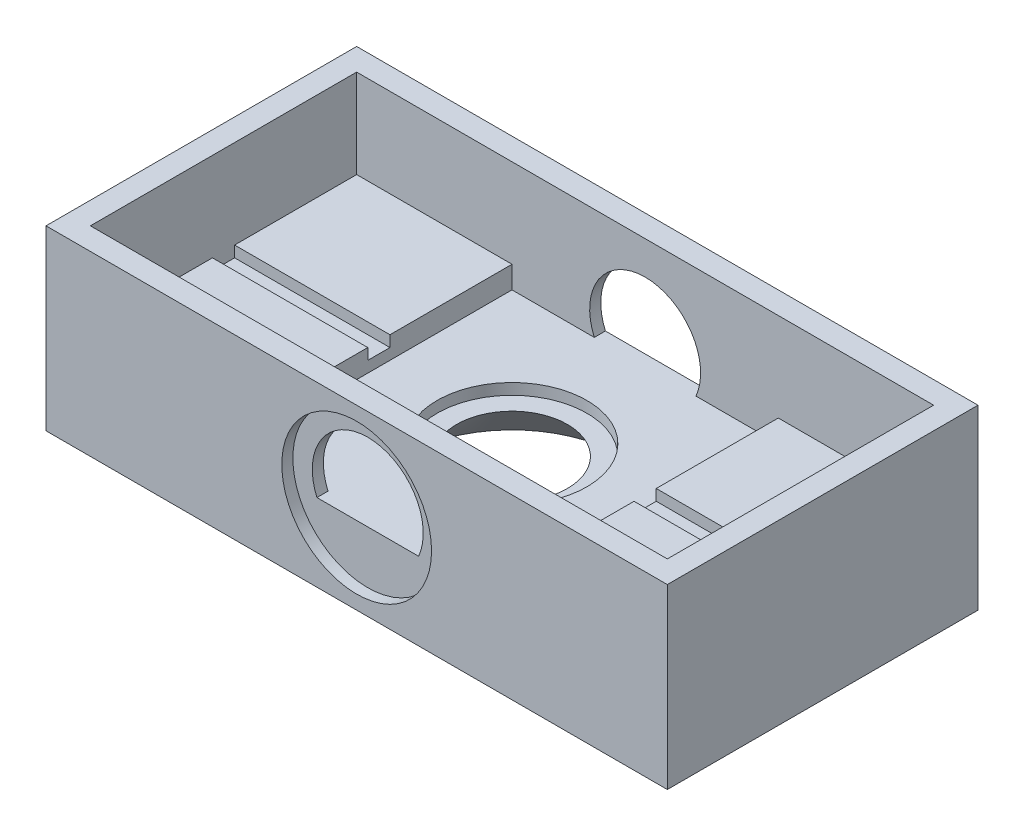
ISO-10303-21;
HEADER;
FILE_DESCRIPTION(('STEP AP214'),'2;1');
FILE_NAME('part.step','',(''),(''),'','','');
FILE_SCHEMA(('AUTOMOTIVE_DESIGN { 1 0 10303 214 1 1 1 1 }'));
ENDSEC;
DATA;
#1=APPLICATION_CONTEXT('core data for automotive mechanical design processes');
#2=APPLICATION_PROTOCOL_DEFINITION('international standard','automotive_design',2000,#1);
#3=PRODUCT_CONTEXT('',#1,'mechanical');
#4=PRODUCT('Part','Part','',(#3));
#5=PRODUCT_RELATED_PRODUCT_CATEGORY('part','',(#4));
#6=PRODUCT_DEFINITION_FORMATION('','',#4);
#7=PRODUCT_DEFINITION_CONTEXT('part definition',#1,'design');
#8=PRODUCT_DEFINITION('design','',#6,#7);
#9=PRODUCT_DEFINITION_SHAPE('','',#8);
#10=(LENGTH_UNIT() NAMED_UNIT(*) SI_UNIT(.MILLI.,.METRE.));
#11=(NAMED_UNIT(*) PLANE_ANGLE_UNIT() SI_UNIT($,.RADIAN.));
#12=(NAMED_UNIT(*) SI_UNIT($,.STERADIAN.) SOLID_ANGLE_UNIT());
#13=UNCERTAINTY_MEASURE_WITH_UNIT(LENGTH_MEASURE(1.E-05),#10,'distance_accuracy_value','');
#14=(GEOMETRIC_REPRESENTATION_CONTEXT(3) GLOBAL_UNCERTAINTY_ASSIGNED_CONTEXT((#13)) GLOBAL_UNIT_ASSIGNED_CONTEXT((#10,
#11,#12)) REPRESENTATION_CONTEXT('',''));
#15=CARTESIAN_POINT('',(0.,0.,0.));
#16=DIRECTION('',(0.,0.,1.));
#17=DIRECTION('',(1.,0.,0.));
#18=AXIS2_PLACEMENT_3D('',#15,#16,#17);
#19=CARTESIAN_POINT('',(0.,8.,-13.));
#20=DIRECTION('',(0.,0.,-1.));
#21=DIRECTION('',(-1.,0.,0.));
#22=AXIS2_PLACEMENT_3D('',#19,#20,#21);
#23=PLANE('',#22);
#24=CARTESIAN_POINT('',(0.,8.,-13.));
#25=DIRECTION('',(0.,0.,-1.));
#26=DIRECTION('',(-1.,0.,0.));
#27=AXIS2_PLACEMENT_3D('',#24,#25,#26);
#28=CIRCLE('',#27,6.75);
#29=CARTESIAN_POINT('',(-6.75,8.,-13.));
#30=VERTEX_POINT('',#29);
#31=EDGE_CURVE('E245',#30,#30,#28,.T.);
#32=ORIENTED_EDGE('',*,*,#31,.T.);
#33=EDGE_LOOP('',(#32));
#34=FACE_BOUND('',#33,.T.);
#35=DIRECTION('',(1.,0.,0.));
#36=VECTOR('',#35,1.);
#37=CARTESIAN_POINT('',(-4.58257569495584,6.,-13.));
#38=LINE('',#37,#36);
#39=CARTESIAN_POINT('',(-4.58257569495584,6.,-13.));
#40=VERTEX_POINT('',#39);
#41=CARTESIAN_POINT('',(4.58257569495584,6.,-13.));
#42=VERTEX_POINT('',#41);
#43=EDGE_CURVE('E206',#40,#42,#38,.T.);
#44=ORIENTED_EDGE('',*,*,#43,.T.);
#45=CARTESIAN_POINT('',(0.,8.,-13.));
#46=DIRECTION('',(0.,0.,-1.));
#47=DIRECTION('',(-1.,0.,0.));
#48=AXIS2_PLACEMENT_3D('',#45,#46,#47);
#49=CIRCLE('',#48,5.);
#50=EDGE_CURVE('E229',#42,#40,#49,.F.);
#51=ORIENTED_EDGE('',*,*,#50,.T.);
#52=EDGE_LOOP('',(#44,#51));
#53=FACE_BOUND('',#52,.T.);
#54=ADVANCED_FACE('F39',(#34,#53),#23,.T.);
#55=CARTESIAN_POINT('',(0.,8.,0.));
#56=DIRECTION('',(0.,1.,0.));
#57=DIRECTION('',(0.,0.,1.));
#58=AXIS2_PLACEMENT_3D('',#55,#56,#57);
#59=PLANE('',#58);
#60=DIRECTION('',(1.,0.,0.));
#61=VECTOR('',#60,1.);
#62=CARTESIAN_POINT('',(-26.,8.,1.));
#63=LINE('',#62,#61);
#64=CARTESIAN_POINT('',(12.,8.,1.));
#65=VERTEX_POINT('',#64);
#66=CARTESIAN_POINT('',(26.,8.,1.));
#67=VERTEX_POINT('',#66);
#68=EDGE_CURVE('E290',#65,#67,#63,.T.);
#69=ORIENTED_EDGE('',*,*,#68,.F.);
#70=DIRECTION('',(0.,0.,-1.));
#71=VECTOR('',#70,1.);
#72=CARTESIAN_POINT('',(12.,8.,12.));
#73=LINE('',#72,#71);
#74=CARTESIAN_POINT('',(12.,8.,12.));
#75=VERTEX_POINT('',#74);
#76=EDGE_CURVE('E337',#75,#65,#73,.T.);
#77=ORIENTED_EDGE('',*,*,#76,.F.);
#78=DIRECTION('',(1.,0.,0.));
#79=VECTOR('',#78,1.);
#80=CARTESIAN_POINT('',(-26.,8.,12.));
#81=LINE('',#80,#79);
#82=CARTESIAN_POINT('',(26.,8.,12.));
#83=VERTEX_POINT('',#82);
#84=EDGE_CURVE('E364',#75,#83,#81,.T.);
#85=ORIENTED_EDGE('',*,*,#84,.T.);
#86=DIRECTION('',(0.,0.,-1.));
#87=VECTOR('',#86,1.);
#88=CARTESIAN_POINT('',(26.,8.,12.));
#89=LINE('',#88,#87);
#90=EDGE_CURVE('E365',#83,#67,#89,.T.);
#91=ORIENTED_EDGE('',*,*,#90,.T.);
#92=EDGE_LOOP('',(#69,#77,#85,#91));
#93=FACE_BOUND('',#92,.T.);
#94=ADVANCED_FACE('F519',(#93),#59,.T.);
#95=CARTESIAN_POINT('',(-26.,8.,1.));
#96=VERTEX_POINT('',#95);
#97=CARTESIAN_POINT('',(-12.,8.,1.));
#98=VERTEX_POINT('',#97);
#99=EDGE_CURVE('E274',#96,#98,#63,.T.);
#100=ORIENTED_EDGE('',*,*,#99,.F.);
#101=DIRECTION('',(0.,0.,1.));
#102=VECTOR('',#101,1.);
#103=CARTESIAN_POINT('',(-26.,8.,-12.));
#104=LINE('',#103,#102);
#105=CARTESIAN_POINT('',(-26.,8.,12.));
#106=VERTEX_POINT('',#105);
#107=EDGE_CURVE('E374',#96,#106,#104,.T.);
#108=ORIENTED_EDGE('',*,*,#107,.T.);
#109=CARTESIAN_POINT('',(-12.,8.,12.));
#110=VERTEX_POINT('',#109);
#111=EDGE_CURVE('E359',#106,#110,#81,.T.);
#112=ORIENTED_EDGE('',*,*,#111,.T.);
#113=DIRECTION('',(0.,0.,1.));
#114=VECTOR('',#113,1.);
#115=CARTESIAN_POINT('',(-12.,8.,12.));
#116=LINE('',#115,#114);
#117=EDGE_CURVE('E341',#98,#110,#116,.T.);
#118=ORIENTED_EDGE('',*,*,#117,.F.);
#119=EDGE_LOOP('',(#100,#108,#112,#118));
#120=FACE_BOUND('',#119,.T.);
#121=ADVANCED_FACE('F482',(#120),#59,.T.);
#122=DIRECTION('',(-1.,0.,0.));
#123=VECTOR('',#122,1.);
#124=CARTESIAN_POINT('',(-26.,8.,-1.));
#125=LINE('',#124,#123);
#126=CARTESIAN_POINT('',(26.,8.,-1.));
#127=VERTEX_POINT('',#126);
#128=CARTESIAN_POINT('',(12.,8.,-1.));
#129=VERTEX_POINT('',#128);
#130=EDGE_CURVE('E287',#127,#129,#125,.T.);
#131=ORIENTED_EDGE('',*,*,#130,.F.);
#132=CARTESIAN_POINT('',(26.,8.,-12.));
#133=VERTEX_POINT('',#132);
#134=EDGE_CURVE('E363',#127,#133,#89,.T.);
#135=ORIENTED_EDGE('',*,*,#134,.T.);
#136=DIRECTION('',(-1.,0.,0.));
#137=VECTOR('',#136,1.);
#138=CARTESIAN_POINT('',(26.,8.,-12.));
#139=LINE('',#138,#137);
#140=CARTESIAN_POINT('',(12.,8.,-12.));
#141=VERTEX_POINT('',#140);
#142=EDGE_CURVE('E370',#133,#141,#139,.T.);
#143=ORIENTED_EDGE('',*,*,#142,.T.);
#144=EDGE_CURVE('E318',#129,#141,#73,.T.);
#145=ORIENTED_EDGE('',*,*,#144,.F.);
#146=EDGE_LOOP('',(#131,#135,#143,#145));
#147=FACE_BOUND('',#146,.T.);
#148=ADVANCED_FACE('F574',(#147),#59,.T.);
#149=CARTESIAN_POINT('',(28.,16.,14.));
#150=DIRECTION('',(-1.,0.,0.));
#151=DIRECTION('',(0.,0.,1.));
#152=AXIS2_PLACEMENT_3D('',#149,#150,#151);
#153=PLANE('',#152);
#154=DIRECTION('',(0.,0.,-1.));
#155=VECTOR('',#154,1.);
#156=CARTESIAN_POINT('',(28.,0.,14.));
#157=LINE('',#156,#155);
#158=CARTESIAN_POINT('',(28.,0.,14.));
#159=VERTEX_POINT('',#158);
#160=CARTESIAN_POINT('',(28.,0.,-14.));
#161=VERTEX_POINT('',#160);
#162=EDGE_CURVE('E397',#159,#161,#157,.T.);
#163=ORIENTED_EDGE('',*,*,#162,.T.);
#164=DIRECTION('',(0.,-1.,0.));
#165=VECTOR('',#164,1.);
#166=CARTESIAN_POINT('',(28.,16.,-14.));
#167=LINE('',#166,#165);
#168=CARTESIAN_POINT('',(28.,16.,-14.));
#169=VERTEX_POINT('',#168);
#170=EDGE_CURVE('E444',#169,#161,#167,.T.);
#171=ORIENTED_EDGE('',*,*,#170,.F.);
#172=DIRECTION('',(0.,0.,-1.));
#173=VECTOR('',#172,1.);
#174=CARTESIAN_POINT('',(28.,16.,14.));
#175=LINE('',#174,#173);
#176=CARTESIAN_POINT('',(28.,16.,14.));
#177=VERTEX_POINT('',#176);
#178=EDGE_CURVE('E407',#177,#169,#175,.T.);
#179=ORIENTED_EDGE('',*,*,#178,.F.);
#180=DIRECTION('',(0.,-1.,0.));
#181=VECTOR('',#180,1.);
#182=CARTESIAN_POINT('',(28.,16.,14.));
#183=LINE('',#182,#181);
#184=EDGE_CURVE('E421',#177,#159,#183,.T.);
#185=ORIENTED_EDGE('',*,*,#184,.T.);
#186=EDGE_LOOP('',(#163,#171,#179,#185));
#187=FACE_BOUND('',#186,.T.);
#188=ADVANCED_FACE('F41',(#187),#153,.F.);
#189=CARTESIAN_POINT('',(-28.,16.,-14.));
#190=DIRECTION('',(0.,0.,1.));
#191=DIRECTION('',(1.,0.,0.));
#192=AXIS2_PLACEMENT_3D('',#189,#190,#191);
#193=PLANE('',#192);
#194=CARTESIAN_POINT('',(0.,8.,-14.));
#195=DIRECTION('',(0.,0.,-1.));
#196=DIRECTION('',(-1.,0.,0.));
#197=AXIS2_PLACEMENT_3D('',#194,#195,#196);
#198=CIRCLE('',#197,6.75);
#199=CARTESIAN_POINT('',(-6.75,8.,-14.));
#200=VERTEX_POINT('',#199);
#201=EDGE_CURVE('E244',#200,#200,#198,.T.);
#202=ORIENTED_EDGE('',*,*,#201,.F.);
#203=EDGE_LOOP('',(#202));
#204=FACE_BOUND('',#203,.T.);
#205=DIRECTION('',(-1.,0.,0.));
#206=VECTOR('',#205,1.);
#207=CARTESIAN_POINT('',(-28.,0.,-14.));
#208=LINE('',#207,#206);
#209=CARTESIAN_POINT('',(-28.,0.,-14.));
#210=VERTEX_POINT('',#209);
#211=EDGE_CURVE('E425',#161,#210,#208,.T.);
#212=ORIENTED_EDGE('',*,*,#211,.T.);
#213=DIRECTION('',(0.,-1.,0.));
#214=VECTOR('',#213,1.);
#215=CARTESIAN_POINT('',(-28.,16.,-14.));
#216=LINE('',#215,#214);
#217=CARTESIAN_POINT('',(-28.,16.,-14.));
#218=VERTEX_POINT('',#217);
#219=EDGE_CURVE('E440',#218,#210,#216,.T.);
#220=ORIENTED_EDGE('',*,*,#219,.F.);
#221=DIRECTION('',(-1.,0.,0.));
#222=VECTOR('',#221,1.);
#223=CARTESIAN_POINT('',(-28.,16.,-14.));
#224=LINE('',#223,#222);
#225=EDGE_CURVE('E411',#169,#218,#224,.T.);
#226=ORIENTED_EDGE('',*,*,#225,.F.);
#227=ORIENTED_EDGE('',*,*,#170,.T.);
#228=EDGE_LOOP('',(#212,#220,#226,#227));
#229=FACE_BOUND('',#228,.T.);
#230=ADVANCED_FACE('F598',(#204,#229),#193,.F.);
#231=CARTESIAN_POINT('',(-28.,16.,14.));
#232=DIRECTION('',(1.,0.,0.));
#233=DIRECTION('',(0.,0.,-1.));
#234=AXIS2_PLACEMENT_3D('',#231,#232,#233);
#235=PLANE('',#234);
#236=DIRECTION('',(0.,0.,1.));
#237=VECTOR('',#236,1.);
#238=CARTESIAN_POINT('',(-28.,0.,14.));
#239=LINE('',#238,#237);
#240=CARTESIAN_POINT('',(-28.,0.,14.));
#241=VERTEX_POINT('',#240);
#242=EDGE_CURVE('E428',#210,#241,#239,.T.);
#243=ORIENTED_EDGE('',*,*,#242,.T.);
#244=DIRECTION('',(0.,-1.,0.));
#245=VECTOR('',#244,1.);
#246=CARTESIAN_POINT('',(-28.,16.,14.));
#247=LINE('',#246,#245);
#248=CARTESIAN_POINT('',(-28.,16.,14.));
#249=VERTEX_POINT('',#248);
#250=EDGE_CURVE('E436',#249,#241,#247,.T.);
#251=ORIENTED_EDGE('',*,*,#250,.F.);
#252=DIRECTION('',(0.,0.,1.));
#253=VECTOR('',#252,1.);
#254=CARTESIAN_POINT('',(-28.,16.,14.));
#255=LINE('',#254,#253);
#256=EDGE_CURVE('E415',#218,#249,#255,.T.);
#257=ORIENTED_EDGE('',*,*,#256,.F.);
#258=ORIENTED_EDGE('',*,*,#219,.T.);
#259=EDGE_LOOP('',(#243,#251,#257,#258));
#260=FACE_BOUND('',#259,.T.);
#261=ADVANCED_FACE('F595',(#260),#235,.F.);
#262=CARTESIAN_POINT('',(-28.,16.,14.));
#263=DIRECTION('',(0.,0.,-1.));
#264=DIRECTION('',(-1.,0.,0.));
#265=AXIS2_PLACEMENT_3D('',#262,#263,#264);
#266=PLANE('',#265);
#267=CARTESIAN_POINT('',(0.,8.,14.));
#268=DIRECTION('',(0.,0.,1.));
#269=DIRECTION('',(1.,0.,0.));
#270=AXIS2_PLACEMENT_3D('',#267,#268,#269);
#271=CIRCLE('',#270,6.75);
#272=CARTESIAN_POINT('',(6.75,8.,14.));
#273=VERTEX_POINT('',#272);
#274=EDGE_CURVE('E249',#273,#273,#271,.T.);
#275=ORIENTED_EDGE('',*,*,#274,.F.);
#276=EDGE_LOOP('',(#275));
#277=FACE_BOUND('',#276,.T.);
#278=DIRECTION('',(1.,0.,0.));
#279=VECTOR('',#278,1.);
#280=CARTESIAN_POINT('',(-28.,0.,14.));
#281=LINE('',#280,#279);
#282=EDGE_CURVE('E412',#241,#159,#281,.T.);
#283=ORIENTED_EDGE('',*,*,#282,.T.);
#284=ORIENTED_EDGE('',*,*,#184,.F.);
#285=DIRECTION('',(1.,0.,0.));
#286=VECTOR('',#285,1.);
#287=CARTESIAN_POINT('',(-28.,16.,14.));
#288=LINE('',#287,#286);
#289=EDGE_CURVE('E418',#249,#177,#288,.T.);
#290=ORIENTED_EDGE('',*,*,#289,.F.);
#291=ORIENTED_EDGE('',*,*,#250,.T.);
#292=EDGE_LOOP('',(#283,#284,#290,#291));
#293=FACE_BOUND('',#292,.T.);
#294=ADVANCED_FACE('F588',(#277,#293),#266,.F.);
#295=CARTESIAN_POINT('',(0.,16.,0.));
#296=DIRECTION('',(0.,-1.,0.));
#297=DIRECTION('',(0.,0.,-1.));
#298=AXIS2_PLACEMENT_3D('',#295,#296,#297);
#299=PLANE('',#298);
#300=DIRECTION('',(0.,0.,-1.));
#301=VECTOR('',#300,1.);
#302=CARTESIAN_POINT('',(26.,16.,12.));
#303=LINE('',#302,#301);
#304=CARTESIAN_POINT('',(26.,16.,12.));
#305=VERTEX_POINT('',#304);
#306=CARTESIAN_POINT('',(26.,16.,-12.));
#307=VERTEX_POINT('',#306);
#308=EDGE_CURVE('E382',#305,#307,#303,.T.);
#309=ORIENTED_EDGE('',*,*,#308,.F.);
#310=DIRECTION('',(1.,0.,0.));
#311=VECTOR('',#310,1.);
#312=CARTESIAN_POINT('',(-26.,16.,12.));
#313=LINE('',#312,#311);
#314=CARTESIAN_POINT('',(-26.,16.,12.));
#315=VERTEX_POINT('',#314);
#316=EDGE_CURVE('E348',#315,#305,#313,.T.);
#317=ORIENTED_EDGE('',*,*,#316,.F.);
#318=DIRECTION('',(0.,0.,1.));
#319=VECTOR('',#318,1.);
#320=CARTESIAN_POINT('',(-26.,16.,-12.));
#321=LINE('',#320,#319);
#322=CARTESIAN_POINT('',(-26.,16.,-12.));
#323=VERTEX_POINT('',#322);
#324=EDGE_CURVE('E390',#323,#315,#321,.T.);
#325=ORIENTED_EDGE('',*,*,#324,.F.);
#326=DIRECTION('',(-1.,0.,0.));
#327=VECTOR('',#326,1.);
#328=CARTESIAN_POINT('',(26.,16.,-12.));
#329=LINE('',#328,#327);
#330=EDGE_CURVE('E386',#307,#323,#329,.T.);
#331=ORIENTED_EDGE('',*,*,#330,.F.);
#332=EDGE_LOOP('',(#309,#317,#325,#331));
#333=FACE_BOUND('',#332,.T.);
#334=ORIENTED_EDGE('',*,*,#178,.T.);
#335=ORIENTED_EDGE('',*,*,#225,.T.);
#336=ORIENTED_EDGE('',*,*,#256,.T.);
#337=ORIENTED_EDGE('',*,*,#289,.T.);
#338=EDGE_LOOP('',(#334,#335,#336,#337));
#339=FACE_BOUND('',#338,.T.);
#340=ADVANCED_FACE('F585',(#333,#339),#299,.F.);
#341=CARTESIAN_POINT('',(0.,0.,0.));
#342=DIRECTION('',(0.,-1.,0.));
#343=DIRECTION('',(0.,0.,-1.));
#344=AXIS2_PLACEMENT_3D('',#341,#342,#343);
#345=PLANE('',#344);
#346=CARTESIAN_POINT('',(0.,0.,0.));
#347=DIRECTION('',(0.,1.,0.));
#348=DIRECTION('',(0.,0.,1.));
#349=AXIS2_PLACEMENT_3D('',#346,#347,#348);
#350=CIRCLE('',#349,10.);
#351=CARTESIAN_POINT('',(0.,0.,10.));
#352=VERTEX_POINT('',#351);
#353=EDGE_CURVE('E223',#352,#352,#350,.T.);
#354=ORIENTED_EDGE('',*,*,#353,.T.);
#355=EDGE_LOOP('',(#354));
#356=FACE_BOUND('',#355,.T.);
#357=ORIENTED_EDGE('',*,*,#162,.F.);
#358=ORIENTED_EDGE('',*,*,#282,.F.);
#359=ORIENTED_EDGE('',*,*,#242,.F.);
#360=ORIENTED_EDGE('',*,*,#211,.F.);
#361=EDGE_LOOP('',(#357,#358,#359,#360));
#362=FACE_BOUND('',#361,.T.);
#363=ADVANCED_FACE('F584',(#356,#362),#345,.T.);
#364=CARTESIAN_POINT('',(-26.,8.,12.));
#365=DIRECTION('',(0.,0.,1.));
#366=DIRECTION('',(1.,0.,0.));
#367=AXIS2_PLACEMENT_3D('',#364,#365,#366);
#368=PLANE('',#367);
#369=DIRECTION('',(1.,0.,0.));
#370=VECTOR('',#369,1.);
#371=CARTESIAN_POINT('',(-12.,6.,12.));
#372=LINE('',#371,#370);
#373=CARTESIAN_POINT('',(4.58257569495584,6.,12.));
#374=VERTEX_POINT('',#373);
#375=CARTESIAN_POINT('',(12.,6.,12.));
#376=VERTEX_POINT('',#375);
#377=EDGE_CURVE('E332',#374,#376,#372,.T.);
#378=ORIENTED_EDGE('',*,*,#377,.F.);
#379=CARTESIAN_POINT('',(0.,8.,12.));
#380=DIRECTION('',(0.,0.,1.));
#381=DIRECTION('',(1.,0.,0.));
#382=AXIS2_PLACEMENT_3D('',#379,#380,#381);
#383=CIRCLE('',#382,5.);
#384=CARTESIAN_POINT('',(-4.58257569495584,6.,12.));
#385=VERTEX_POINT('',#384);
#386=EDGE_CURVE('E203',#374,#385,#383,.T.);
#387=ORIENTED_EDGE('',*,*,#386,.T.);
#388=CARTESIAN_POINT('',(-12.,6.,12.));
#389=VERTEX_POINT('',#388);
#390=EDGE_CURVE('E333',#389,#385,#372,.T.);
#391=ORIENTED_EDGE('',*,*,#390,.F.);
#392=DIRECTION('',(0.,1.,0.));
#393=VECTOR('',#392,1.);
#394=CARTESIAN_POINT('',(-12.,6.,12.));
#395=LINE('',#394,#393);
#396=EDGE_CURVE('E349',#389,#110,#395,.T.);
#397=ORIENTED_EDGE('',*,*,#396,.T.);
#398=ORIENTED_EDGE('',*,*,#111,.F.);
#399=DIRECTION('',(0.,1.,0.));
#400=VECTOR('',#399,1.);
#401=CARTESIAN_POINT('',(-26.,8.,12.));
#402=LINE('',#401,#400);
#403=EDGE_CURVE('E394',#106,#315,#402,.T.);
#404=ORIENTED_EDGE('',*,*,#403,.T.);
#405=ORIENTED_EDGE('',*,*,#316,.T.);
#406=DIRECTION('',(0.,1.,0.));
#407=VECTOR('',#406,1.);
#408=CARTESIAN_POINT('',(26.,8.,12.));
#409=LINE('',#408,#407);
#410=EDGE_CURVE('E379',#83,#305,#409,.T.);
#411=ORIENTED_EDGE('',*,*,#410,.F.);
#412=ORIENTED_EDGE('',*,*,#84,.F.);
#413=DIRECTION('',(0.,1.,0.));
#414=VECTOR('',#413,1.);
#415=CARTESIAN_POINT('',(12.,6.,12.));
#416=LINE('',#415,#414);
#417=EDGE_CURVE('E345',#376,#75,#416,.T.);
#418=ORIENTED_EDGE('',*,*,#417,.F.);
#419=EDGE_LOOP('',(#378,#387,#391,#397,#398,#404,#405,#411,#412,#418));
#420=FACE_BOUND('',#419,.T.);
#421=ADVANCED_FACE('F490',(#420),#368,.F.);
#422=CARTESIAN_POINT('',(-26.,8.,-12.));
#423=DIRECTION('',(-1.,0.,0.));
#424=DIRECTION('',(0.,0.,1.));
#425=AXIS2_PLACEMENT_3D('',#422,#423,#424);
#426=PLANE('',#425);
#427=ORIENTED_EDGE('',*,*,#324,.T.);
#428=ORIENTED_EDGE('',*,*,#403,.F.);
#429=ORIENTED_EDGE('',*,*,#107,.F.);
#430=DIRECTION('',(0.,1.,0.));
#431=VECTOR('',#430,1.);
#432=CARTESIAN_POINT('',(-26.,7.,1.));
#433=LINE('',#432,#431);
#434=CARTESIAN_POINT('',(-26.,7.,1.));
#435=VERTEX_POINT('',#434);
#436=EDGE_CURVE('E298',#435,#96,#433,.T.);
#437=ORIENTED_EDGE('',*,*,#436,.F.);
#438=DIRECTION('',(0.,0.,1.));
#439=VECTOR('',#438,1.);
#440=CARTESIAN_POINT('',(-26.,7.,1.));
#441=LINE('',#440,#439);
#442=CARTESIAN_POINT('',(-26.,7.,-1.));
#443=VERTEX_POINT('',#442);
#444=EDGE_CURVE('E278',#443,#435,#441,.T.);
#445=ORIENTED_EDGE('',*,*,#444,.F.);
#446=DIRECTION('',(0.,1.,0.));
#447=VECTOR('',#446,1.);
#448=CARTESIAN_POINT('',(-26.,7.,-1.));
#449=LINE('',#448,#447);
#450=CARTESIAN_POINT('',(-26.,8.,-1.));
#451=VERTEX_POINT('',#450);
#452=EDGE_CURVE('E301',#443,#451,#449,.T.);
#453=ORIENTED_EDGE('',*,*,#452,.T.);
#454=CARTESIAN_POINT('',(-26.,8.,-12.));
#455=VERTEX_POINT('',#454);
#456=EDGE_CURVE('E375',#455,#451,#104,.T.);
#457=ORIENTED_EDGE('',*,*,#456,.F.);
#458=DIRECTION('',(0.,1.,0.));
#459=VECTOR('',#458,1.);
#460=CARTESIAN_POINT('',(-26.,8.,-12.));
#461=LINE('',#460,#459);
#462=EDGE_CURVE('E398',#455,#323,#461,.T.);
#463=ORIENTED_EDGE('',*,*,#462,.T.);
#464=EDGE_LOOP('',(#427,#428,#429,#437,#445,#453,#457,#463));
#465=FACE_BOUND('',#464,.T.);
#466=ADVANCED_FACE('F486',(#465),#426,.F.);
#467=CARTESIAN_POINT('',(26.,8.,-12.));
#468=DIRECTION('',(0.,0.,-1.));
#469=DIRECTION('',(-1.,0.,0.));
#470=AXIS2_PLACEMENT_3D('',#467,#468,#469);
#471=PLANE('',#470);
#472=DIRECTION('',(-1.,0.,0.));
#473=VECTOR('',#472,1.);
#474=CARTESIAN_POINT('',(-12.,6.,-12.));
#475=LINE('',#474,#473);
#476=CARTESIAN_POINT('',(-4.58257569495584,6.,-12.));
#477=VERTEX_POINT('',#476);
#478=CARTESIAN_POINT('',(-12.,6.,-12.));
#479=VERTEX_POINT('',#478);
#480=EDGE_CURVE('E323',#477,#479,#475,.T.);
#481=ORIENTED_EDGE('',*,*,#480,.F.);
#482=CARTESIAN_POINT('',(0.,8.,-12.));
#483=DIRECTION('',(0.,0.,-1.));
#484=DIRECTION('',(-1.,0.,0.));
#485=AXIS2_PLACEMENT_3D('',#482,#483,#484);
#486=CIRCLE('',#485,5.);
#487=CARTESIAN_POINT('',(4.58257569495584,6.,-12.));
#488=VERTEX_POINT('',#487);
#489=EDGE_CURVE('E238',#477,#488,#486,.T.);
#490=ORIENTED_EDGE('',*,*,#489,.T.);
#491=CARTESIAN_POINT('',(12.,6.,-12.));
#492=VERTEX_POINT('',#491);
#493=EDGE_CURVE('E325',#492,#488,#475,.T.);
#494=ORIENTED_EDGE('',*,*,#493,.F.);
#495=DIRECTION('',(0.,1.,0.));
#496=VECTOR('',#495,1.);
#497=CARTESIAN_POINT('',(12.,6.,-12.));
#498=LINE('',#497,#496);
#499=EDGE_CURVE('E336',#492,#141,#498,.T.);
#500=ORIENTED_EDGE('',*,*,#499,.T.);
#501=ORIENTED_EDGE('',*,*,#142,.F.);
#502=DIRECTION('',(0.,1.,0.));
#503=VECTOR('',#502,1.);
#504=CARTESIAN_POINT('',(26.,8.,-12.));
#505=LINE('',#504,#503);
#506=EDGE_CURVE('E401',#133,#307,#505,.T.);
#507=ORIENTED_EDGE('',*,*,#506,.T.);
#508=ORIENTED_EDGE('',*,*,#330,.T.);
#509=ORIENTED_EDGE('',*,*,#462,.F.);
#510=CARTESIAN_POINT('',(-12.,8.,-12.));
#511=VERTEX_POINT('',#510);
#512=EDGE_CURVE('E369',#511,#455,#139,.T.);
#513=ORIENTED_EDGE('',*,*,#512,.F.);
#514=DIRECTION('',(0.,1.,0.));
#515=VECTOR('',#514,1.);
#516=CARTESIAN_POINT('',(-12.,6.,-12.));
#517=LINE('',#516,#515);
#518=EDGE_CURVE('E353',#479,#511,#517,.T.);
#519=ORIENTED_EDGE('',*,*,#518,.F.);
#520=EDGE_LOOP('',(#481,#490,#494,#500,#501,#507,#508,#509,#513,#519));
#521=FACE_BOUND('',#520,.T.);
#522=ADVANCED_FACE('F497',(#521),#471,.F.);
#523=CARTESIAN_POINT('',(26.,8.,12.));
#524=DIRECTION('',(1.,0.,0.));
#525=DIRECTION('',(0.,0.,-1.));
#526=AXIS2_PLACEMENT_3D('',#523,#524,#525);
#527=PLANE('',#526);
#528=ORIENTED_EDGE('',*,*,#308,.T.);
#529=ORIENTED_EDGE('',*,*,#506,.F.);
#530=ORIENTED_EDGE('',*,*,#134,.F.);
#531=DIRECTION('',(0.,1.,0.));
#532=VECTOR('',#531,1.);
#533=CARTESIAN_POINT('',(26.,7.,-1.));
#534=LINE('',#533,#532);
#535=CARTESIAN_POINT('',(26.,7.,-1.));
#536=VERTEX_POINT('',#535);
#537=EDGE_CURVE('E286',#536,#127,#534,.T.);
#538=ORIENTED_EDGE('',*,*,#537,.F.);
#539=DIRECTION('',(0.,0.,-1.));
#540=VECTOR('',#539,1.);
#541=CARTESIAN_POINT('',(26.,7.,1.));
#542=LINE('',#541,#540);
#543=CARTESIAN_POINT('',(26.,7.,1.));
#544=VERTEX_POINT('',#543);
#545=EDGE_CURVE('E269',#544,#536,#542,.T.);
#546=ORIENTED_EDGE('',*,*,#545,.F.);
#547=DIRECTION('',(0.,1.,0.));
#548=VECTOR('',#547,1.);
#549=CARTESIAN_POINT('',(26.,7.,1.));
#550=LINE('',#549,#548);
#551=EDGE_CURVE('E293',#544,#67,#550,.T.);
#552=ORIENTED_EDGE('',*,*,#551,.T.);
#553=ORIENTED_EDGE('',*,*,#90,.F.);
#554=ORIENTED_EDGE('',*,*,#410,.T.);
#555=EDGE_LOOP('',(#528,#529,#530,#538,#546,#552,#553,#554));
#556=FACE_BOUND('',#555,.T.);
#557=ADVANCED_FACE('F573',(#556),#527,.F.);
#558=CARTESIAN_POINT('',(-12.,8.,-1.));
#559=VERTEX_POINT('',#558);
#560=EDGE_CURVE('E265',#559,#451,#125,.T.);
#561=ORIENTED_EDGE('',*,*,#560,.F.);
#562=EDGE_CURVE('E324',#511,#559,#116,.T.);
#563=ORIENTED_EDGE('',*,*,#562,.F.);
#564=ORIENTED_EDGE('',*,*,#512,.T.);
#565=ORIENTED_EDGE('',*,*,#456,.T.);
#566=EDGE_LOOP('',(#561,#563,#564,#565));
#567=FACE_BOUND('',#566,.T.);
#568=ADVANCED_FACE('F462',(#567),#59,.T.);
#569=CARTESIAN_POINT('',(12.,6.,12.));
#570=DIRECTION('',(1.,0.,0.));
#571=DIRECTION('',(0.,0.,-1.));
#572=AXIS2_PLACEMENT_3D('',#569,#570,#571);
#573=PLANE('',#572);
#574=ORIENTED_EDGE('',*,*,#76,.T.);
#575=DIRECTION('',(0.,-1.,0.));
#576=VECTOR('',#575,1.);
#577=CARTESIAN_POINT('',(12.,6.,0.999999999999999));
#578=LINE('',#577,#576);
#579=CARTESIAN_POINT('',(12.,7.,1.));
#580=VERTEX_POINT('',#579);
#581=EDGE_CURVE('E314',#65,#580,#578,.T.);
#582=ORIENTED_EDGE('',*,*,#581,.T.);
#583=DIRECTION('',(0.,0.,-1.));
#584=VECTOR('',#583,1.);
#585=CARTESIAN_POINT('',(12.,7.,12.));
#586=LINE('',#585,#584);
#587=CARTESIAN_POINT('',(12.,7.,-1.));
#588=VERTEX_POINT('',#587);
#589=EDGE_CURVE('E297',#580,#588,#586,.T.);
#590=ORIENTED_EDGE('',*,*,#589,.T.);
#591=DIRECTION('',(0.,1.,0.));
#592=VECTOR('',#591,1.);
#593=CARTESIAN_POINT('',(12.,6.,-0.999999999999999));
#594=LINE('',#593,#592);
#595=EDGE_CURVE('E310',#588,#129,#594,.T.);
#596=ORIENTED_EDGE('',*,*,#595,.T.);
#597=ORIENTED_EDGE('',*,*,#144,.T.);
#598=ORIENTED_EDGE('',*,*,#499,.F.);
#599=DIRECTION('',(0.,0.,-1.));
#600=VECTOR('',#599,1.);
#601=CARTESIAN_POINT('',(12.,6.,12.));
#602=LINE('',#601,#600);
#603=EDGE_CURVE('E319',#376,#492,#602,.T.);
#604=ORIENTED_EDGE('',*,*,#603,.F.);
#605=ORIENTED_EDGE('',*,*,#417,.T.);
#606=EDGE_LOOP('',(#574,#582,#590,#596,#597,#598,#604,#605));
#607=FACE_BOUND('',#606,.T.);
#608=ADVANCED_FACE('F565',(#607),#573,.F.);
#609=CARTESIAN_POINT('',(-12.,6.,12.));
#610=DIRECTION('',(-1.,0.,0.));
#611=DIRECTION('',(0.,0.,1.));
#612=AXIS2_PLACEMENT_3D('',#609,#610,#611);
#613=PLANE('',#612);
#614=DIRECTION('',(0.,0.,1.));
#615=VECTOR('',#614,1.);
#616=CARTESIAN_POINT('',(-12.,7.,12.));
#617=LINE('',#616,#615);
#618=CARTESIAN_POINT('',(-12.,7.,-1.));
#619=VERTEX_POINT('',#618);
#620=CARTESIAN_POINT('',(-12.,7.,1.));
#621=VERTEX_POINT('',#620);
#622=EDGE_CURVE('E448',#619,#621,#617,.T.);
#623=ORIENTED_EDGE('',*,*,#622,.T.);
#624=DIRECTION('',(0.,1.,0.));
#625=VECTOR('',#624,1.);
#626=CARTESIAN_POINT('',(-12.,6.,0.999999999999999));
#627=LINE('',#626,#625);
#628=EDGE_CURVE('E11',#621,#98,#627,.T.);
#629=ORIENTED_EDGE('',*,*,#628,.T.);
#630=ORIENTED_EDGE('',*,*,#117,.T.);
#631=ORIENTED_EDGE('',*,*,#396,.F.);
#632=DIRECTION('',(0.,0.,1.));
#633=VECTOR('',#632,1.);
#634=CARTESIAN_POINT('',(-12.,6.,12.));
#635=LINE('',#634,#633);
#636=EDGE_CURVE('E328',#479,#389,#635,.T.);
#637=ORIENTED_EDGE('',*,*,#636,.F.);
#638=ORIENTED_EDGE('',*,*,#518,.T.);
#639=ORIENTED_EDGE('',*,*,#562,.T.);
#640=DIRECTION('',(0.,-1.,0.));
#641=VECTOR('',#640,1.);
#642=CARTESIAN_POINT('',(-12.,6.,-0.999999999999999));
#643=LINE('',#642,#641);
#644=EDGE_CURVE('E48',#559,#619,#643,.T.);
#645=ORIENTED_EDGE('',*,*,#644,.T.);
#646=EDGE_LOOP('',(#623,#629,#630,#631,#637,#638,#639,#645));
#647=FACE_BOUND('',#646,.T.);
#648=ADVANCED_FACE('F454',(#647),#613,.F.);
#649=CARTESIAN_POINT('',(0.,6.,0.));
#650=DIRECTION('',(0.,-1.,0.));
#651=DIRECTION('',(0.,0.,-1.));
#652=AXIS2_PLACEMENT_3D('',#649,#650,#651);
#653=PLANE('',#652);
#654=CARTESIAN_POINT('',(0.,6.,0.));
#655=DIRECTION('',(0.,1.,0.));
#656=DIRECTION('',(0.,0.,1.));
#657=AXIS2_PLACEMENT_3D('',#654,#655,#656);
#658=CIRCLE('',#657,6.75);
#659=CARTESIAN_POINT('',(0.,6.,6.75));
#660=VERTEX_POINT('',#659);
#661=EDGE_CURVE('E257',#660,#660,#658,.T.);
#662=ORIENTED_EDGE('',*,*,#661,.F.);
#663=EDGE_LOOP('',(#662));
#664=FACE_BOUND('',#663,.T.);
#665=ORIENTED_EDGE('',*,*,#390,.T.);
#666=DIRECTION('',(0.,0.,1.));
#667=VECTOR('',#666,1.);
#668=CARTESIAN_POINT('',(-4.58257569495584,6.,-25.2065556157337));
#669=LINE('',#668,#667);
#670=CARTESIAN_POINT('',(-4.58257569495584,6.,13.));
#671=VERTEX_POINT('',#670);
#672=EDGE_CURVE('E212',#385,#671,#669,.T.);
#673=ORIENTED_EDGE('',*,*,#672,.T.);
#674=DIRECTION('',(1.,0.,0.));
#675=VECTOR('',#674,1.);
#676=CARTESIAN_POINT('',(-4.58257569495584,6.,13.));
#677=LINE('',#676,#675);
#678=CARTESIAN_POINT('',(4.58257569495584,6.,13.));
#679=VERTEX_POINT('',#678);
#680=EDGE_CURVE('E209',#671,#679,#677,.T.);
#681=ORIENTED_EDGE('',*,*,#680,.T.);
#682=DIRECTION('',(0.,0.,1.));
#683=VECTOR('',#682,1.);
#684=CARTESIAN_POINT('',(4.58257569495584,6.,-25.2065556157337));
#685=LINE('',#684,#683);
#686=EDGE_CURVE('E199',#374,#679,#685,.T.);
#687=ORIENTED_EDGE('',*,*,#686,.F.);
#688=ORIENTED_EDGE('',*,*,#377,.T.);
#689=ORIENTED_EDGE('',*,*,#603,.T.);
#690=ORIENTED_EDGE('',*,*,#493,.T.);
#691=EDGE_CURVE('E63',#42,#488,#685,.T.);
#692=ORIENTED_EDGE('',*,*,#691,.F.);
#693=ORIENTED_EDGE('',*,*,#43,.F.);
#694=EDGE_CURVE('E234',#40,#477,#669,.T.);
#695=ORIENTED_EDGE('',*,*,#694,.T.);
#696=ORIENTED_EDGE('',*,*,#480,.T.);
#697=ORIENTED_EDGE('',*,*,#636,.T.);
#698=EDGE_LOOP('',(#665,#673,#681,#687,#688,#689,#690,#692,#693,#695,#696,#697));
#699=FACE_BOUND('',#698,.T.);
#700=ADVANCED_FACE('F211',(#664,#699),#653,.F.);
#701=CARTESIAN_POINT('',(0.,7.,0.));
#702=DIRECTION('',(0.,-1.,0.));
#703=DIRECTION('',(0.,0.,-1.));
#704=AXIS2_PLACEMENT_3D('',#701,#702,#703);
#705=PLANE('',#704);
#706=DIRECTION('',(-1.,0.,0.));
#707=VECTOR('',#706,1.);
#708=CARTESIAN_POINT('',(-26.,7.,-1.));
#709=LINE('',#708,#707);
#710=EDGE_CURVE('E273',#619,#443,#709,.T.);
#711=ORIENTED_EDGE('',*,*,#710,.T.);
#712=ORIENTED_EDGE('',*,*,#444,.T.);
#713=DIRECTION('',(1.,0.,0.));
#714=VECTOR('',#713,1.);
#715=CARTESIAN_POINT('',(-26.,7.,1.));
#716=LINE('',#715,#714);
#717=EDGE_CURVE('E283',#435,#621,#716,.T.);
#718=ORIENTED_EDGE('',*,*,#717,.T.);
#719=ORIENTED_EDGE('',*,*,#622,.F.);
#720=EDGE_LOOP('',(#711,#712,#718,#719));
#721=FACE_BOUND('',#720,.T.);
#722=ADVANCED_FACE('F503',(#721),#705,.F.);
#723=CARTESIAN_POINT('',(-26.,7.,-1.));
#724=DIRECTION('',(0.,0.,-1.));
#725=DIRECTION('',(-1.,0.,0.));
#726=AXIS2_PLACEMENT_3D('',#723,#724,#725);
#727=PLANE('',#726);
#728=ORIENTED_EDGE('',*,*,#560,.T.);
#729=ORIENTED_EDGE('',*,*,#452,.F.);
#730=ORIENTED_EDGE('',*,*,#710,.F.);
#731=ORIENTED_EDGE('',*,*,#644,.F.);
#732=EDGE_LOOP('',(#728,#729,#730,#731));
#733=FACE_BOUND('',#732,.T.);
#734=ADVANCED_FACE('F459',(#733),#727,.F.);
#735=CARTESIAN_POINT('',(-26.,7.,1.));
#736=DIRECTION('',(0.,0.,1.));
#737=DIRECTION('',(1.,0.,0.));
#738=AXIS2_PLACEMENT_3D('',#735,#736,#737);
#739=PLANE('',#738);
#740=ORIENTED_EDGE('',*,*,#717,.F.);
#741=ORIENTED_EDGE('',*,*,#436,.T.);
#742=ORIENTED_EDGE('',*,*,#99,.T.);
#743=ORIENTED_EDGE('',*,*,#628,.F.);
#744=EDGE_LOOP('',(#740,#741,#742,#743));
#745=FACE_BOUND('',#744,.T.);
#746=ADVANCED_FACE('F506',(#745),#739,.F.);
#747=ORIENTED_EDGE('',*,*,#68,.T.);
#748=ORIENTED_EDGE('',*,*,#551,.F.);
#749=EDGE_CURVE('E282',#580,#544,#716,.T.);
#750=ORIENTED_EDGE('',*,*,#749,.F.);
#751=ORIENTED_EDGE('',*,*,#581,.F.);
#752=EDGE_LOOP('',(#747,#748,#750,#751));
#753=FACE_BOUND('',#752,.T.);
#754=ADVANCED_FACE('F508',(#753),#739,.F.);
#755=EDGE_CURVE('E275',#536,#588,#709,.T.);
#756=ORIENTED_EDGE('',*,*,#755,.F.);
#757=ORIENTED_EDGE('',*,*,#537,.T.);
#758=ORIENTED_EDGE('',*,*,#130,.T.);
#759=ORIENTED_EDGE('',*,*,#595,.F.);
#760=EDGE_LOOP('',(#756,#757,#758,#759));
#761=FACE_BOUND('',#760,.T.);
#762=ADVANCED_FACE('F514',(#761),#727,.F.);
#763=ORIENTED_EDGE('',*,*,#749,.T.);
#764=ORIENTED_EDGE('',*,*,#545,.T.);
#765=ORIENTED_EDGE('',*,*,#755,.T.);
#766=ORIENTED_EDGE('',*,*,#589,.F.);
#767=EDGE_LOOP('',(#763,#764,#765,#766));
#768=FACE_BOUND('',#767,.T.);
#769=ADVANCED_FACE('F548',(#768),#705,.F.);
#770=CARTESIAN_POINT('',(0.,5.,0.));
#771=DIRECTION('',(0.,1.,0.));
#772=DIRECTION('',(0.,0.,1.));
#773=AXIS2_PLACEMENT_3D('',#770,#771,#772);
#774=CYLINDRICAL_SURFACE('',#773,6.75);
#775=CARTESIAN_POINT('',(0.,5.,0.));
#776=DIRECTION('',(0.,1.,0.));
#777=DIRECTION('',(0.,0.,1.));
#778=AXIS2_PLACEMENT_3D('',#775,#776,#777);
#779=CIRCLE('',#778,6.75);
#780=CARTESIAN_POINT('',(0.,5.,6.75));
#781=VERTEX_POINT('',#780);
#782=EDGE_CURVE('E261',#781,#781,#779,.T.);
#783=ORIENTED_EDGE('',*,*,#782,.F.);
#784=EDGE_LOOP('',(#783));
#785=FACE_BOUND('',#784,.T.);
#786=ORIENTED_EDGE('',*,*,#661,.T.);
#787=EDGE_LOOP('',(#786));
#788=FACE_BOUND('',#787,.T.);
#789=ADVANCED_FACE('F545',(#785,#788),#774,.F.);
#790=CARTESIAN_POINT('',(0.,5.,0.));
#791=DIRECTION('',(0.,1.,0.));
#792=DIRECTION('',(0.,0.,1.));
#793=AXIS2_PLACEMENT_3D('',#790,#791,#792);
#794=PLANE('',#793);
#795=CARTESIAN_POINT('',(0.,5.,0.));
#796=DIRECTION('',(0.,-1.,0.));
#797=DIRECTION('',(0.,0.,-1.));
#798=AXIS2_PLACEMENT_3D('',#795,#796,#797);
#799=CIRCLE('',#798,5.);
#800=CARTESIAN_POINT('',(0.,5.,-5.));
#801=VERTEX_POINT('',#800);
#802=EDGE_CURVE('E219',#801,#801,#799,.T.);
#803=ORIENTED_EDGE('',*,*,#802,.T.);
#804=EDGE_LOOP('',(#803));
#805=FACE_BOUND('',#804,.T.);
#806=ORIENTED_EDGE('',*,*,#782,.T.);
#807=EDGE_LOOP('',(#806));
#808=FACE_BOUND('',#807,.T.);
#809=ADVANCED_FACE('F541',(#805,#808),#794,.T.);
#810=CARTESIAN_POINT('',(0.,8.,13.));
#811=DIRECTION('',(0.,0.,1.));
#812=DIRECTION('',(1.,0.,0.));
#813=AXIS2_PLACEMENT_3D('',#810,#811,#812);
#814=CYLINDRICAL_SURFACE('',#813,6.75);
#815=CARTESIAN_POINT('',(0.,8.,13.));
#816=DIRECTION('',(0.,0.,1.));
#817=DIRECTION('',(1.,0.,0.));
#818=AXIS2_PLACEMENT_3D('',#815,#816,#817);
#819=CIRCLE('',#818,6.75);
#820=CARTESIAN_POINT('',(6.75,8.,13.));
#821=VERTEX_POINT('',#820);
#822=EDGE_CURVE('E253',#821,#821,#819,.T.);
#823=ORIENTED_EDGE('',*,*,#822,.F.);
#824=EDGE_LOOP('',(#823));
#825=FACE_BOUND('',#824,.T.);
#826=ORIENTED_EDGE('',*,*,#274,.T.);
#827=EDGE_LOOP('',(#826));
#828=FACE_BOUND('',#827,.T.);
#829=ADVANCED_FACE('F538',(#825,#828),#814,.F.);
#830=CARTESIAN_POINT('',(0.,8.,13.));
#831=DIRECTION('',(0.,0.,1.));
#832=DIRECTION('',(1.,0.,0.));
#833=AXIS2_PLACEMENT_3D('',#830,#831,#832);
#834=PLANE('',#833);
#835=CARTESIAN_POINT('',(0.,8.,13.));
#836=DIRECTION('',(0.,0.,1.));
#837=DIRECTION('',(1.,0.,0.));
#838=AXIS2_PLACEMENT_3D('',#835,#836,#837);
#839=CIRCLE('',#838,5.);
#840=EDGE_CURVE('E55',#679,#671,#839,.T.);
#841=ORIENTED_EDGE('',*,*,#840,.F.);
#842=ORIENTED_EDGE('',*,*,#680,.F.);
#843=EDGE_LOOP('',(#841,#842));
#844=FACE_BOUND('',#843,.T.);
#845=ORIENTED_EDGE('',*,*,#822,.T.);
#846=EDGE_LOOP('',(#845));
#847=FACE_BOUND('',#846,.T.);
#848=ADVANCED_FACE('F216',(#844,#847),#834,.T.);
#849=CARTESIAN_POINT('',(0.,8.,-13.));
#850=DIRECTION('',(0.,0.,-1.));
#851=DIRECTION('',(-1.,0.,0.));
#852=AXIS2_PLACEMENT_3D('',#849,#850,#851);
#853=CYLINDRICAL_SURFACE('',#852,6.75);
#854=ORIENTED_EDGE('',*,*,#31,.F.);
#855=EDGE_LOOP('',(#854));
#856=FACE_BOUND('',#855,.T.);
#857=ORIENTED_EDGE('',*,*,#201,.T.);
#858=EDGE_LOOP('',(#857));
#859=FACE_BOUND('',#858,.T.);
#860=ADVANCED_FACE('F531',(#856,#859),#853,.F.);
#861=CARTESIAN_POINT('',(0.,8.,-25.2065556157337));
#862=DIRECTION('',(0.,0.,1.));
#863=DIRECTION('',(1.,0.,0.));
#864=AXIS2_PLACEMENT_3D('',#861,#862,#863);
#865=CYLINDRICAL_SURFACE('',#864,5.);
#866=ORIENTED_EDGE('',*,*,#694,.F.);
#867=ORIENTED_EDGE('',*,*,#50,.F.);
#868=ORIENTED_EDGE('',*,*,#691,.T.);
#869=ORIENTED_EDGE('',*,*,#489,.F.);
#870=EDGE_LOOP('',(#866,#867,#868,#869));
#871=FACE_BOUND('',#870,.T.);
#872=ADVANCED_FACE('F534',(#871),#865,.F.);
#873=ORIENTED_EDGE('',*,*,#686,.T.);
#874=ORIENTED_EDGE('',*,*,#840,.T.);
#875=ORIENTED_EDGE('',*,*,#672,.F.);
#876=ORIENTED_EDGE('',*,*,#386,.F.);
#877=EDGE_LOOP('',(#873,#874,#875,#876));
#878=FACE_BOUND('',#877,.T.);
#879=ADVANCED_FACE('F201',(#878),#865,.F.);
#880=CARTESIAN_POINT('',(0.,10.,0.));
#881=DIRECTION('',(0.,-1.,0.));
#882=DIRECTION('',(0.,0.,-1.));
#883=AXIS2_PLACEMENT_3D('',#880,#881,#882);
#884=CONICAL_SURFACE('',#883,0.,0.785398163397448);
#885=ORIENTED_EDGE('',*,*,#353,.F.);
#886=EDGE_LOOP('',(#885));
#887=FACE_BOUND('',#886,.T.);
#888=ORIENTED_EDGE('',*,*,#802,.F.);
#889=EDGE_LOOP('',(#888));
#890=FACE_BOUND('',#889,.T.);
#891=ADVANCED_FACE('F653',(#887,#890),#884,.F.);
#892=CLOSED_SHELL('',(#54,#94,#121,#148,#188,#230,#261,#294,#340,#363,#421,#466,#522,#557,#568,
#608,#648,#700,#722,#734,#746,#754,#762,#769,#789,#809,#829,#848,#860,#872,#879,#891));
#893=MANIFOLD_SOLID_BREP('B2',#892);
#894=ADVANCED_BREP_SHAPE_REPRESENTATION('',(#18,#893),#14);
#895=SHAPE_DEFINITION_REPRESENTATION(#9,#894);
ENDSEC;
END-ISO-10303-21;
